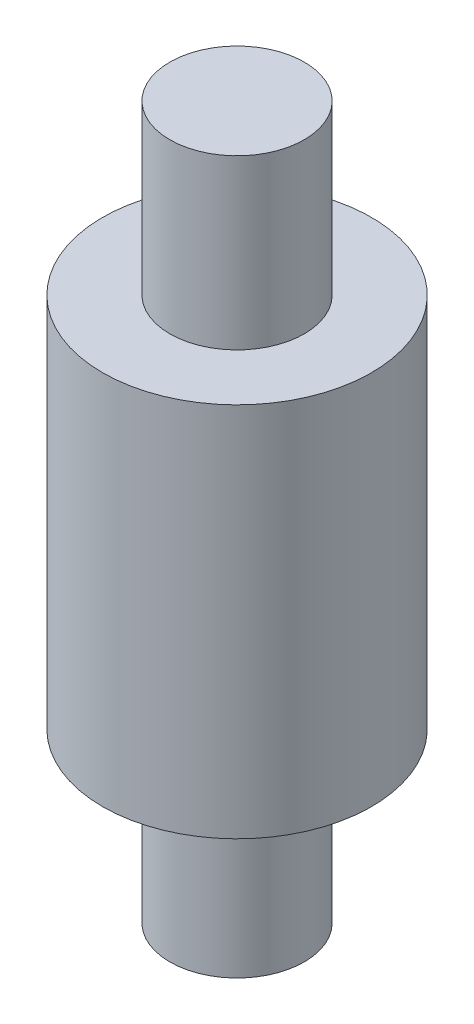
ISO-10303-21;
HEADER;
FILE_DESCRIPTION(('STEP AP214'),'2;1');
FILE_NAME('part.step','',(''),(''),'','','');
FILE_SCHEMA(('AUTOMOTIVE_DESIGN { 1 0 10303 214 1 1 1 1 }'));
ENDSEC;
DATA;
#1=APPLICATION_CONTEXT('core data for automotive mechanical design processes');
#2=APPLICATION_PROTOCOL_DEFINITION('international standard','automotive_design',2000,#1);
#3=PRODUCT_CONTEXT('',#1,'mechanical');
#4=PRODUCT('Part','Part','',(#3));
#5=PRODUCT_RELATED_PRODUCT_CATEGORY('part','',(#4));
#6=PRODUCT_DEFINITION_FORMATION('','',#4);
#7=PRODUCT_DEFINITION_CONTEXT('part definition',#1,'design');
#8=PRODUCT_DEFINITION('design','',#6,#7);
#9=PRODUCT_DEFINITION_SHAPE('','',#8);
#10=(LENGTH_UNIT() NAMED_UNIT(*) SI_UNIT(.MILLI.,.METRE.));
#11=(NAMED_UNIT(*) PLANE_ANGLE_UNIT() SI_UNIT($,.RADIAN.));
#12=(NAMED_UNIT(*) SI_UNIT($,.STERADIAN.) SOLID_ANGLE_UNIT());
#13=UNCERTAINTY_MEASURE_WITH_UNIT(LENGTH_MEASURE(1.E-05),#10,'distance_accuracy_value','');
#14=(GEOMETRIC_REPRESENTATION_CONTEXT(3) GLOBAL_UNCERTAINTY_ASSIGNED_CONTEXT((#13)) GLOBAL_UNIT_ASSIGNED_CONTEXT((#10,
#11,#12)) REPRESENTATION_CONTEXT('',''));
#15=CARTESIAN_POINT('',(0.,0.,0.));
#16=DIRECTION('',(0.,0.,1.));
#17=DIRECTION('',(1.,0.,0.));
#18=AXIS2_PLACEMENT_3D('',#15,#16,#17);
#19=CARTESIAN_POINT('',(3.4544,0.,0.));
#20=DIRECTION('',(0.,1.,0.));
#21=DIRECTION('',(0.,0.,1.));
#22=AXIS2_PLACEMENT_3D('',#19,#20,#21);
#23=PLANE('',#22);
#24=CARTESIAN_POINT('',(0.,0.,0.));
#25=DIRECTION('',(0.,1.,0.));
#26=DIRECTION('',(0.,0.,1.));
#27=AXIS2_PLACEMENT_3D('',#24,#25,#26);
#28=CIRCLE('',#27,1.7272);
#29=CARTESIAN_POINT('',(0.,0.,1.7272));
#30=VERTEX_POINT('',#29);
#31=EDGE_CURVE('E17',#30,#30,#28,.T.);
#32=ORIENTED_EDGE('',*,*,#31,.F.);
#33=EDGE_LOOP('',(#32));
#34=FACE_BOUND('',#33,.T.);
#35=ADVANCED_FACE('F14',(#34),#23,.F.);
#36=CARTESIAN_POINT('',(0.,18.288,0.));
#37=DIRECTION('',(0.,-1.,0.));
#38=DIRECTION('',(0.,0.,-1.));
#39=AXIS2_PLACEMENT_3D('',#36,#37,#38);
#40=PLANE('',#39);
#41=CARTESIAN_POINT('',(0.,18.288,0.));
#42=DIRECTION('',(0.,1.,0.));
#43=DIRECTION('',(0.,0.,1.));
#44=AXIS2_PLACEMENT_3D('',#41,#42,#43);
#45=CIRCLE('',#44,1.7272);
#46=CARTESIAN_POINT('',(0.,18.288,1.7272));
#47=VERTEX_POINT('',#46);
#48=EDGE_CURVE('E33',#47,#47,#45,.F.);
#49=ORIENTED_EDGE('',*,*,#48,.F.);
#50=EDGE_LOOP('',(#49));
#51=FACE_BOUND('',#50,.T.);
#52=ADVANCED_FACE('F43',(#51),#40,.F.);
#53=CARTESIAN_POINT('',(0.,0.,0.));
#54=DIRECTION('',(0.,1.,0.));
#55=DIRECTION('',(0.,0.,1.));
#56=AXIS2_PLACEMENT_3D('',#53,#54,#55);
#57=CYLINDRICAL_SURFACE('',#56,1.7272);
#58=CARTESIAN_POINT('',(0.,4.318,0.));
#59=DIRECTION('',(0.,1.,0.));
#60=DIRECTION('',(0.,0.,1.));
#61=AXIS2_PLACEMENT_3D('',#58,#59,#60);
#62=CIRCLE('',#61,1.7272);
#63=CARTESIAN_POINT('',(0.,4.318,1.7272));
#64=VERTEX_POINT('',#63);
#65=EDGE_CURVE('E31',#64,#64,#62,.F.);
#66=ORIENTED_EDGE('',*,*,#65,.T.);
#67=EDGE_LOOP('',(#66));
#68=FACE_BOUND('',#67,.T.);
#69=ORIENTED_EDGE('',*,*,#31,.T.);
#70=EDGE_LOOP('',(#69));
#71=FACE_BOUND('',#70,.T.);
#72=ADVANCED_FACE('F40',(#68,#71),#57,.T.);
#73=CARTESIAN_POINT('',(0.,13.97,0.));
#74=DIRECTION('',(0.,1.,0.));
#75=DIRECTION('',(0.,0.,1.));
#76=AXIS2_PLACEMENT_3D('',#73,#74,#75);
#77=CYLINDRICAL_SURFACE('',#76,1.7272);
#78=ORIENTED_EDGE('',*,*,#48,.T.);
#79=EDGE_LOOP('',(#78));
#80=FACE_BOUND('',#79,.T.);
#81=CARTESIAN_POINT('',(0.,13.97,0.));
#82=DIRECTION('',(0.,1.,0.));
#83=DIRECTION('',(0.,0.,1.));
#84=AXIS2_PLACEMENT_3D('',#81,#82,#83);
#85=CIRCLE('',#84,1.7272);
#86=CARTESIAN_POINT('',(0.,13.97,1.7272));
#87=VERTEX_POINT('',#86);
#88=EDGE_CURVE('E26',#87,#87,#85,.T.);
#89=ORIENTED_EDGE('',*,*,#88,.T.);
#90=EDGE_LOOP('',(#89));
#91=FACE_BOUND('',#90,.T.);
#92=ADVANCED_FACE('F63',(#80,#91),#77,.T.);
#93=CARTESIAN_POINT('',(3.4544,4.318,0.));
#94=DIRECTION('',(0.,1.,0.));
#95=DIRECTION('',(0.,0.,1.));
#96=AXIS2_PLACEMENT_3D('',#93,#94,#95);
#97=PLANE('',#96);
#98=CARTESIAN_POINT('',(0.,4.318,0.));
#99=DIRECTION('',(0.,1.,0.));
#100=DIRECTION('',(0.,0.,1.));
#101=AXIS2_PLACEMENT_3D('',#98,#99,#100);
#102=CIRCLE('',#101,3.4544);
#103=CARTESIAN_POINT('',(0.,4.318,3.4544));
#104=VERTEX_POINT('',#103);
#105=EDGE_CURVE('E21',#104,#104,#102,.T.);
#106=ORIENTED_EDGE('',*,*,#105,.F.);
#107=EDGE_LOOP('',(#106));
#108=FACE_BOUND('',#107,.T.);
#109=ORIENTED_EDGE('',*,*,#65,.F.);
#110=EDGE_LOOP('',(#109));
#111=FACE_BOUND('',#110,.T.);
#112=ADVANCED_FACE('F56',(#108,#111),#97,.F.);
#113=CARTESIAN_POINT('',(1.7272,13.97,0.));
#114=DIRECTION('',(0.,-1.,0.));
#115=DIRECTION('',(0.,0.,-1.));
#116=AXIS2_PLACEMENT_3D('',#113,#114,#115);
#117=PLANE('',#116);
#118=ORIENTED_EDGE('',*,*,#88,.F.);
#119=EDGE_LOOP('',(#118));
#120=FACE_BOUND('',#119,.T.);
#121=CARTESIAN_POINT('',(0.,13.97,0.));
#122=DIRECTION('',(0.,1.,0.));
#123=DIRECTION('',(0.,0.,1.));
#124=AXIS2_PLACEMENT_3D('',#121,#122,#123);
#125=CIRCLE('',#124,3.4544);
#126=CARTESIAN_POINT('',(0.,13.97,3.4544));
#127=VERTEX_POINT('',#126);
#128=EDGE_CURVE('E9',#127,#127,#125,.F.);
#129=ORIENTED_EDGE('',*,*,#128,.F.);
#130=EDGE_LOOP('',(#129));
#131=FACE_BOUND('',#130,.T.);
#132=ADVANCED_FACE('F51',(#120,#131),#117,.F.);
#133=CARTESIAN_POINT('',(0.,0.,0.));
#134=DIRECTION('',(0.,1.,0.));
#135=DIRECTION('',(0.,0.,1.));
#136=AXIS2_PLACEMENT_3D('',#133,#134,#135);
#137=CYLINDRICAL_SURFACE('',#136,3.4544);
#138=ORIENTED_EDGE('',*,*,#128,.T.);
#139=EDGE_LOOP('',(#138));
#140=FACE_BOUND('',#139,.T.);
#141=ORIENTED_EDGE('',*,*,#105,.T.);
#142=EDGE_LOOP('',(#141));
#143=FACE_BOUND('',#142,.T.);
#144=ADVANCED_FACE('F49',(#140,#143),#137,.T.);
#145=CLOSED_SHELL('',(#35,#52,#72,#92,#112,#132,#144));
#146=MANIFOLD_SOLID_BREP('B1',#145);
#147=ADVANCED_BREP_SHAPE_REPRESENTATION('',(#18,#146),#14);
#148=SHAPE_DEFINITION_REPRESENTATION(#9,#147);
ENDSEC;
END-ISO-10303-21;
